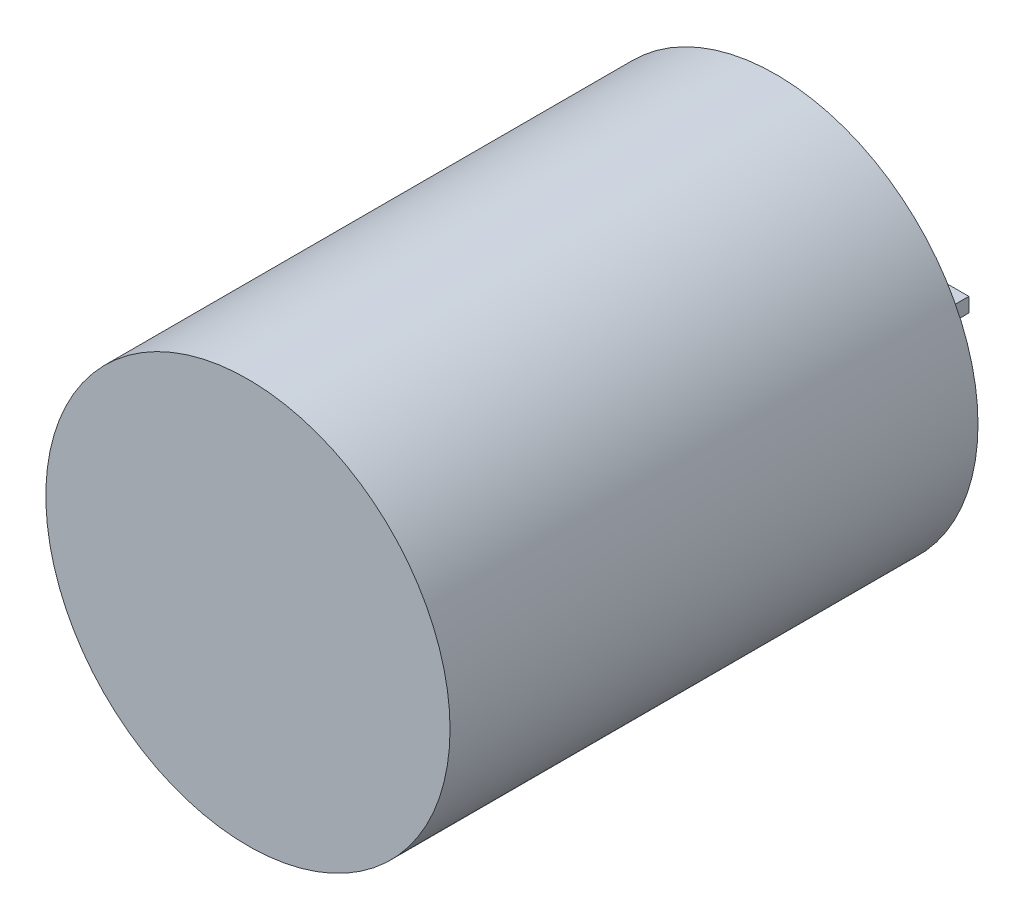
ISO-10303-21;
HEADER;
FILE_DESCRIPTION(('STEP AP214'),'2;1');
FILE_NAME('part.step','',(''),(''),'','','');
FILE_SCHEMA(('AUTOMOTIVE_DESIGN { 1 0 10303 214 1 1 1 1 }'));
ENDSEC;
DATA;
#1=APPLICATION_CONTEXT('core data for automotive mechanical design processes');
#2=APPLICATION_PROTOCOL_DEFINITION('international standard','automotive_design',2000,#1);
#3=PRODUCT_CONTEXT('',#1,'mechanical');
#4=PRODUCT('Part','Part','',(#3));
#5=PRODUCT_RELATED_PRODUCT_CATEGORY('part','',(#4));
#6=PRODUCT_DEFINITION_FORMATION('','',#4);
#7=PRODUCT_DEFINITION_CONTEXT('part definition',#1,'design');
#8=PRODUCT_DEFINITION('design','',#6,#7);
#9=PRODUCT_DEFINITION_SHAPE('','',#8);
#10=(LENGTH_UNIT() NAMED_UNIT(*) SI_UNIT(.MILLI.,.METRE.));
#11=(NAMED_UNIT(*) PLANE_ANGLE_UNIT() SI_UNIT($,.RADIAN.));
#12=(NAMED_UNIT(*) SI_UNIT($,.STERADIAN.) SOLID_ANGLE_UNIT());
#13=UNCERTAINTY_MEASURE_WITH_UNIT(LENGTH_MEASURE(1.E-05),#10,'distance_accuracy_value','');
#14=(GEOMETRIC_REPRESENTATION_CONTEXT(3) GLOBAL_UNCERTAINTY_ASSIGNED_CONTEXT((#13)) GLOBAL_UNIT_ASSIGNED_CONTEXT((#10,
#11,#12)) REPRESENTATION_CONTEXT('',''));
#15=CARTESIAN_POINT('',(0.,0.,0.));
#16=DIRECTION('',(0.,0.,1.));
#17=DIRECTION('',(1.,0.,0.));
#18=AXIS2_PLACEMENT_3D('',#15,#16,#17);
#19=CARTESIAN_POINT('',(0.,0.,32.512));
#20=DIRECTION('',(0.,0.,-1.));
#21=DIRECTION('',(-1.,0.,0.));
#22=AXIS2_PLACEMENT_3D('',#19,#20,#21);
#23=CYLINDRICAL_SURFACE('',#22,12.446);
#24=CARTESIAN_POINT('',(0.,0.,32.512));
#25=DIRECTION('',(0.,0.,1.));
#26=DIRECTION('',(1.,0.,0.));
#27=AXIS2_PLACEMENT_3D('',#24,#25,#26);
#28=CIRCLE('',#27,12.446);
#29=CARTESIAN_POINT('',(12.446,0.,32.512));
#30=VERTEX_POINT('',#29);
#31=EDGE_CURVE('E11',#30,#30,#28,.T.);
#32=ORIENTED_EDGE('',*,*,#31,.F.);
#33=EDGE_LOOP('',(#32));
#34=FACE_BOUND('',#33,.T.);
#35=CARTESIAN_POINT('',(0.,0.,0.));
#36=DIRECTION('',(0.,0.,1.));
#37=DIRECTION('',(1.,0.,0.));
#38=AXIS2_PLACEMENT_3D('',#35,#36,#37);
#39=CIRCLE('',#38,12.446);
#40=CARTESIAN_POINT('',(12.446,0.,0.));
#41=VERTEX_POINT('',#40);
#42=EDGE_CURVE('E42',#41,#41,#39,.T.);
#43=ORIENTED_EDGE('',*,*,#42,.T.);
#44=EDGE_LOOP('',(#43));
#45=FACE_BOUND('',#44,.T.);
#46=ADVANCED_FACE('F39',(#34,#45),#23,.T.);
#47=CARTESIAN_POINT('',(0.,0.,32.512));
#48=DIRECTION('',(0.,0.,1.));
#49=DIRECTION('',(1.,0.,0.));
#50=AXIS2_PLACEMENT_3D('',#47,#48,#49);
#51=PLANE('',#50);
#52=ORIENTED_EDGE('',*,*,#31,.T.);
#53=EDGE_LOOP('',(#52));
#54=FACE_BOUND('',#53,.T.);
#55=ADVANCED_FACE('F225',(#54),#51,.T.);
#56=CARTESIAN_POINT('',(0.,0.,0.));
#57=DIRECTION('',(0.,0.,1.));
#58=DIRECTION('',(1.,0.,0.));
#59=AXIS2_PLACEMENT_3D('',#56,#57,#58);
#60=PLANE('',#59);
#61=DIRECTION('',(-1.,0.,0.));
#62=VECTOR('',#61,1.);
#63=CARTESIAN_POINT('',(4.21742747939887,0.4445,0.));
#64=LINE('',#63,#62);
#65=CARTESIAN_POINT('',(5.78257252060113,0.4445,0.));
#66=VERTEX_POINT('',#65);
#67=CARTESIAN_POINT('',(4.21742747939887,0.4445,0.));
#68=VERTEX_POINT('',#67);
#69=EDGE_CURVE('E132',#66,#68,#64,.T.);
#70=ORIENTED_EDGE('',*,*,#69,.T.);
#71=DIRECTION('',(0.,-1.,0.));
#72=VECTOR('',#71,1.);
#73=CARTESIAN_POINT('',(4.21742747939887,0.4445,0.));
#74=LINE('',#73,#72);
#75=CARTESIAN_POINT('',(4.21742747939887,-0.4445,0.));
#76=VERTEX_POINT('',#75);
#77=EDGE_CURVE('E142',#68,#76,#74,.T.);
#78=ORIENTED_EDGE('',*,*,#77,.T.);
#79=DIRECTION('',(1.,0.,0.));
#80=VECTOR('',#79,1.);
#81=CARTESIAN_POINT('',(4.21742747939887,-0.4445,0.));
#82=LINE('',#81,#80);
#83=CARTESIAN_POINT('',(5.78257252060113,-0.4445,0.));
#84=VERTEX_POINT('',#83);
#85=EDGE_CURVE('E109',#76,#84,#82,.T.);
#86=ORIENTED_EDGE('',*,*,#85,.T.);
#87=DIRECTION('',(0.,1.,0.));
#88=VECTOR('',#87,1.);
#89=CARTESIAN_POINT('',(5.78257252060113,0.4445,0.));
#90=LINE('',#89,#88);
#91=EDGE_CURVE('E54',#84,#66,#90,.T.);
#92=ORIENTED_EDGE('',*,*,#91,.T.);
#93=EDGE_LOOP('',(#70,#78,#86,#92));
#94=FACE_BOUND('',#93,.T.);
#95=DIRECTION('',(-1.,0.,0.));
#96=VECTOR('',#95,1.);
#97=CARTESIAN_POINT('',(-5.78257252060113,0.4445,0.));
#98=LINE('',#97,#96);
#99=CARTESIAN_POINT('',(-4.21742747939887,0.4445,0.));
#100=VERTEX_POINT('',#99);
#101=CARTESIAN_POINT('',(-5.78257252060113,0.4445,0.));
#102=VERTEX_POINT('',#101);
#103=EDGE_CURVE('E162',#100,#102,#98,.T.);
#104=ORIENTED_EDGE('',*,*,#103,.T.);
#105=DIRECTION('',(0.,-1.,0.));
#106=VECTOR('',#105,1.);
#107=CARTESIAN_POINT('',(-5.78257252060113,-0.4445,0.));
#108=LINE('',#107,#106);
#109=CARTESIAN_POINT('',(-5.78257252060113,-0.4445,0.));
#110=VERTEX_POINT('',#109);
#111=EDGE_CURVE('E151',#102,#110,#108,.T.);
#112=ORIENTED_EDGE('',*,*,#111,.T.);
#113=DIRECTION('',(1.,0.,0.));
#114=VECTOR('',#113,1.);
#115=CARTESIAN_POINT('',(-5.78257252060113,-0.4445,0.));
#116=LINE('',#115,#114);
#117=CARTESIAN_POINT('',(-4.21742747939887,-0.4445,0.));
#118=VERTEX_POINT('',#117);
#119=EDGE_CURVE('E178',#110,#118,#116,.T.);
#120=ORIENTED_EDGE('',*,*,#119,.T.);
#121=DIRECTION('',(0.,1.,0.));
#122=VECTOR('',#121,1.);
#123=CARTESIAN_POINT('',(-4.21742747939887,-0.4445,0.));
#124=LINE('',#123,#122);
#125=EDGE_CURVE('E62',#118,#100,#124,.T.);
#126=ORIENTED_EDGE('',*,*,#125,.T.);
#127=EDGE_LOOP('',(#104,#112,#120,#126));
#128=FACE_BOUND('',#127,.T.);
#129=ORIENTED_EDGE('',*,*,#42,.F.);
#130=EDGE_LOOP('',(#129));
#131=FACE_BOUND('',#130,.T.);
#132=ADVANCED_FACE('F206',(#94,#128,#131),#60,.F.);
#133=CARTESIAN_POINT('',(-5.78257252060113,-0.4445,-6.1));
#134=DIRECTION('',(-1.,0.,0.));
#135=DIRECTION('',(0.,0.,1.));
#136=AXIS2_PLACEMENT_3D('',#133,#134,#135);
#137=PLANE('',#136);
#138=ORIENTED_EDGE('',*,*,#111,.F.);
#139=DIRECTION('',(0.,0.,1.));
#140=VECTOR('',#139,1.);
#141=CARTESIAN_POINT('',(-5.78257252060113,0.4445,-6.1));
#142=LINE('',#141,#140);
#143=CARTESIAN_POINT('',(-5.78257252060113,0.4445,-6.1));
#144=VERTEX_POINT('',#143);
#145=EDGE_CURVE('E187',#144,#102,#142,.T.);
#146=ORIENTED_EDGE('',*,*,#145,.F.);
#147=DIRECTION('',(0.,-1.,0.));
#148=VECTOR('',#147,1.);
#149=CARTESIAN_POINT('',(-5.78257252060113,-0.4445,-6.1));
#150=LINE('',#149,#148);
#151=CARTESIAN_POINT('',(-5.78257252060113,-0.4445,-6.1));
#152=VERTEX_POINT('',#151);
#153=EDGE_CURVE('E157',#144,#152,#150,.T.);
#154=ORIENTED_EDGE('',*,*,#153,.T.);
#155=DIRECTION('',(0.,0.,1.));
#156=VECTOR('',#155,1.);
#157=CARTESIAN_POINT('',(-5.78257252060113,-0.4445,-6.1));
#158=LINE('',#157,#156);
#159=EDGE_CURVE('E174',#152,#110,#158,.T.);
#160=ORIENTED_EDGE('',*,*,#159,.T.);
#161=EDGE_LOOP('',(#138,#146,#154,#160));
#162=FACE_BOUND('',#161,.T.);
#163=ADVANCED_FACE('F200',(#162),#137,.T.);
#164=CARTESIAN_POINT('',(-5.78257252060113,0.4445,-6.1));
#165=DIRECTION('',(0.,1.,0.));
#166=DIRECTION('',(0.,0.,1.));
#167=AXIS2_PLACEMENT_3D('',#164,#165,#166);
#168=PLANE('',#167);
#169=ORIENTED_EDGE('',*,*,#103,.F.);
#170=DIRECTION('',(0.,0.,1.));
#171=VECTOR('',#170,1.);
#172=CARTESIAN_POINT('',(-4.21742747939887,0.4445,-6.1));
#173=LINE('',#172,#171);
#174=CARTESIAN_POINT('',(-4.21742747939887,0.4445,-6.1));
#175=VERTEX_POINT('',#174);
#176=EDGE_CURVE('E190',#175,#100,#173,.T.);
#177=ORIENTED_EDGE('',*,*,#176,.F.);
#178=DIRECTION('',(-1.,0.,0.));
#179=VECTOR('',#178,1.);
#180=CARTESIAN_POINT('',(-5.78257252060113,0.4445,-6.1));
#181=LINE('',#180,#179);
#182=EDGE_CURVE('E170',#175,#144,#181,.T.);
#183=ORIENTED_EDGE('',*,*,#182,.T.);
#184=ORIENTED_EDGE('',*,*,#145,.T.);
#185=EDGE_LOOP('',(#169,#177,#183,#184));
#186=FACE_BOUND('',#185,.T.);
#187=ADVANCED_FACE('F210',(#186),#168,.T.);
#188=CARTESIAN_POINT('',(-4.21742747939887,-0.4445,-6.1));
#189=DIRECTION('',(1.,0.,0.));
#190=DIRECTION('',(0.,0.,-1.));
#191=AXIS2_PLACEMENT_3D('',#188,#189,#190);
#192=PLANE('',#191);
#193=ORIENTED_EDGE('',*,*,#125,.F.);
#194=DIRECTION('',(0.,0.,1.));
#195=VECTOR('',#194,1.);
#196=CARTESIAN_POINT('',(-4.21742747939887,-0.4445,-6.1));
#197=LINE('',#196,#195);
#198=CARTESIAN_POINT('',(-4.21742747939887,-0.4445,-6.1));
#199=VERTEX_POINT('',#198);
#200=EDGE_CURVE('E193',#199,#118,#197,.T.);
#201=ORIENTED_EDGE('',*,*,#200,.F.);
#202=DIRECTION('',(0.,1.,0.));
#203=VECTOR('',#202,1.);
#204=CARTESIAN_POINT('',(-4.21742747939887,-0.4445,-6.1));
#205=LINE('',#204,#203);
#206=EDGE_CURVE('E166',#199,#175,#205,.T.);
#207=ORIENTED_EDGE('',*,*,#206,.T.);
#208=ORIENTED_EDGE('',*,*,#176,.T.);
#209=EDGE_LOOP('',(#193,#201,#207,#208));
#210=FACE_BOUND('',#209,.T.);
#211=ADVANCED_FACE('F215',(#210),#192,.T.);
#212=CARTESIAN_POINT('',(-5.78257252060113,-0.4445,-6.1));
#213=DIRECTION('',(0.,-1.,0.));
#214=DIRECTION('',(0.,0.,-1.));
#215=AXIS2_PLACEMENT_3D('',#212,#213,#214);
#216=PLANE('',#215);
#217=ORIENTED_EDGE('',*,*,#119,.F.);
#218=ORIENTED_EDGE('',*,*,#159,.F.);
#219=DIRECTION('',(1.,0.,0.));
#220=VECTOR('',#219,1.);
#221=CARTESIAN_POINT('',(-5.78257252060113,-0.4445,-6.1));
#222=LINE('',#221,#220);
#223=EDGE_CURVE('E161',#152,#199,#222,.T.);
#224=ORIENTED_EDGE('',*,*,#223,.T.);
#225=ORIENTED_EDGE('',*,*,#200,.T.);
#226=EDGE_LOOP('',(#217,#218,#224,#225));
#227=FACE_BOUND('',#226,.T.);
#228=ADVANCED_FACE('F204',(#227),#216,.T.);
#229=CARTESIAN_POINT('',(0.,0.,-6.1));
#230=DIRECTION('',(0.,0.,-1.));
#231=DIRECTION('',(-1.,0.,0.));
#232=AXIS2_PLACEMENT_3D('',#229,#230,#231);
#233=PLANE('',#232);
#234=ORIENTED_EDGE('',*,*,#153,.F.);
#235=ORIENTED_EDGE('',*,*,#182,.F.);
#236=ORIENTED_EDGE('',*,*,#206,.F.);
#237=ORIENTED_EDGE('',*,*,#223,.F.);
#238=EDGE_LOOP('',(#234,#235,#236,#237));
#239=FACE_BOUND('',#238,.T.);
#240=ADVANCED_FACE('F213',(#239),#233,.T.);
#241=CARTESIAN_POINT('',(4.21742747939887,0.4445,-6.1));
#242=DIRECTION('',(-1.,0.,0.));
#243=DIRECTION('',(0.,0.,1.));
#244=AXIS2_PLACEMENT_3D('',#241,#242,#243);
#245=PLANE('',#244);
#246=ORIENTED_EDGE('',*,*,#77,.F.);
#247=DIRECTION('',(0.,0.,1.));
#248=VECTOR('',#247,1.);
#249=CARTESIAN_POINT('',(4.21742747939887,0.4445,-6.1));
#250=LINE('',#249,#248);
#251=CARTESIAN_POINT('',(4.21742747939887,0.4445,-6.1));
#252=VERTEX_POINT('',#251);
#253=EDGE_CURVE('E130',#252,#68,#250,.T.);
#254=ORIENTED_EDGE('',*,*,#253,.F.);
#255=DIRECTION('',(0.,-1.,0.));
#256=VECTOR('',#255,1.);
#257=CARTESIAN_POINT('',(4.21742747939887,0.4445,-6.1));
#258=LINE('',#257,#256);
#259=CARTESIAN_POINT('',(4.21742747939887,-0.4445,-6.1));
#260=VERTEX_POINT('',#259);
#261=EDGE_CURVE('E123',#252,#260,#258,.T.);
#262=ORIENTED_EDGE('',*,*,#261,.T.);
#263=DIRECTION('',(0.,0.,1.));
#264=VECTOR('',#263,1.);
#265=CARTESIAN_POINT('',(4.21742747939887,-0.4445,-6.1));
#266=LINE('',#265,#264);
#267=EDGE_CURVE('E104',#260,#76,#266,.T.);
#268=ORIENTED_EDGE('',*,*,#267,.T.);
#269=EDGE_LOOP('',(#246,#254,#262,#268));
#270=FACE_BOUND('',#269,.T.);
#271=ADVANCED_FACE('F129',(#270),#245,.T.);
#272=CARTESIAN_POINT('',(4.21742747939887,0.4445,-6.1));
#273=DIRECTION('',(0.,1.,0.));
#274=DIRECTION('',(0.,0.,1.));
#275=AXIS2_PLACEMENT_3D('',#272,#273,#274);
#276=PLANE('',#275);
#277=ORIENTED_EDGE('',*,*,#69,.F.);
#278=DIRECTION('',(0.,0.,1.));
#279=VECTOR('',#278,1.);
#280=CARTESIAN_POINT('',(5.78257252060113,0.4445,-6.1));
#281=LINE('',#280,#279);
#282=CARTESIAN_POINT('',(5.78257252060113,0.4445,-6.1));
#283=VERTEX_POINT('',#282);
#284=EDGE_CURVE('E152',#283,#66,#281,.T.);
#285=ORIENTED_EDGE('',*,*,#284,.F.);
#286=DIRECTION('',(-1.,0.,0.));
#287=VECTOR('',#286,1.);
#288=CARTESIAN_POINT('',(4.21742747939887,0.4445,-6.1));
#289=LINE('',#288,#287);
#290=EDGE_CURVE('E116',#283,#252,#289,.T.);
#291=ORIENTED_EDGE('',*,*,#290,.T.);
#292=ORIENTED_EDGE('',*,*,#253,.T.);
#293=EDGE_LOOP('',(#277,#285,#291,#292));
#294=FACE_BOUND('',#293,.T.);
#295=ADVANCED_FACE('F245',(#294),#276,.T.);
#296=CARTESIAN_POINT('',(5.78257252060113,0.4445,-6.1));
#297=DIRECTION('',(1.,0.,0.));
#298=DIRECTION('',(0.,0.,-1.));
#299=AXIS2_PLACEMENT_3D('',#296,#297,#298);
#300=PLANE('',#299);
#301=ORIENTED_EDGE('',*,*,#91,.F.);
#302=DIRECTION('',(0.,0.,1.));
#303=VECTOR('',#302,1.);
#304=CARTESIAN_POINT('',(5.78257252060113,-0.4445,-6.1));
#305=LINE('',#304,#303);
#306=CARTESIAN_POINT('',(5.78257252060113,-0.4445,-6.1));
#307=VERTEX_POINT('',#306);
#308=EDGE_CURVE('E115',#307,#84,#305,.T.);
#309=ORIENTED_EDGE('',*,*,#308,.F.);
#310=DIRECTION('',(0.,1.,0.));
#311=VECTOR('',#310,1.);
#312=CARTESIAN_POINT('',(5.78257252060113,0.4445,-6.1));
#313=LINE('',#312,#311);
#314=EDGE_CURVE('E126',#307,#283,#313,.T.);
#315=ORIENTED_EDGE('',*,*,#314,.T.);
#316=ORIENTED_EDGE('',*,*,#284,.T.);
#317=EDGE_LOOP('',(#301,#309,#315,#316));
#318=FACE_BOUND('',#317,.T.);
#319=ADVANCED_FACE('F246',(#318),#300,.T.);
#320=CARTESIAN_POINT('',(4.21742747939887,-0.4445,-6.1));
#321=DIRECTION('',(0.,-1.,0.));
#322=DIRECTION('',(0.,0.,-1.));
#323=AXIS2_PLACEMENT_3D('',#320,#321,#322);
#324=PLANE('',#323);
#325=ORIENTED_EDGE('',*,*,#85,.F.);
#326=ORIENTED_EDGE('',*,*,#267,.F.);
#327=DIRECTION('',(1.,0.,0.));
#328=VECTOR('',#327,1.);
#329=CARTESIAN_POINT('',(4.21742747939887,-0.4445,-6.1));
#330=LINE('',#329,#328);
#331=EDGE_CURVE('E107',#260,#307,#330,.T.);
#332=ORIENTED_EDGE('',*,*,#331,.T.);
#333=ORIENTED_EDGE('',*,*,#308,.T.);
#334=EDGE_LOOP('',(#325,#326,#332,#333));
#335=FACE_BOUND('',#334,.T.);
#336=ADVANCED_FACE('F106',(#335),#324,.T.);
#337=CARTESIAN_POINT('',(0.,0.,-6.1));
#338=DIRECTION('',(0.,0.,1.));
#339=DIRECTION('',(1.,0.,0.));
#340=AXIS2_PLACEMENT_3D('',#337,#338,#339);
#341=PLANE('',#340);
#342=ORIENTED_EDGE('',*,*,#261,.F.);
#343=ORIENTED_EDGE('',*,*,#290,.F.);
#344=ORIENTED_EDGE('',*,*,#314,.F.);
#345=ORIENTED_EDGE('',*,*,#331,.F.);
#346=EDGE_LOOP('',(#342,#343,#344,#345));
#347=FACE_BOUND('',#346,.T.);
#348=ADVANCED_FACE('F121',(#347),#341,.F.);
#349=CLOSED_SHELL('',(#46,#55,#132,#163,#187,#211,#228,#240,#271,#295,#319,#336,#348));
#350=MANIFOLD_SOLID_BREP('B2',#349);
#351=ADVANCED_BREP_SHAPE_REPRESENTATION('',(#18,#350),#14);
#352=SHAPE_DEFINITION_REPRESENTATION(#9,#351);
ENDSEC;
END-ISO-10303-21;
